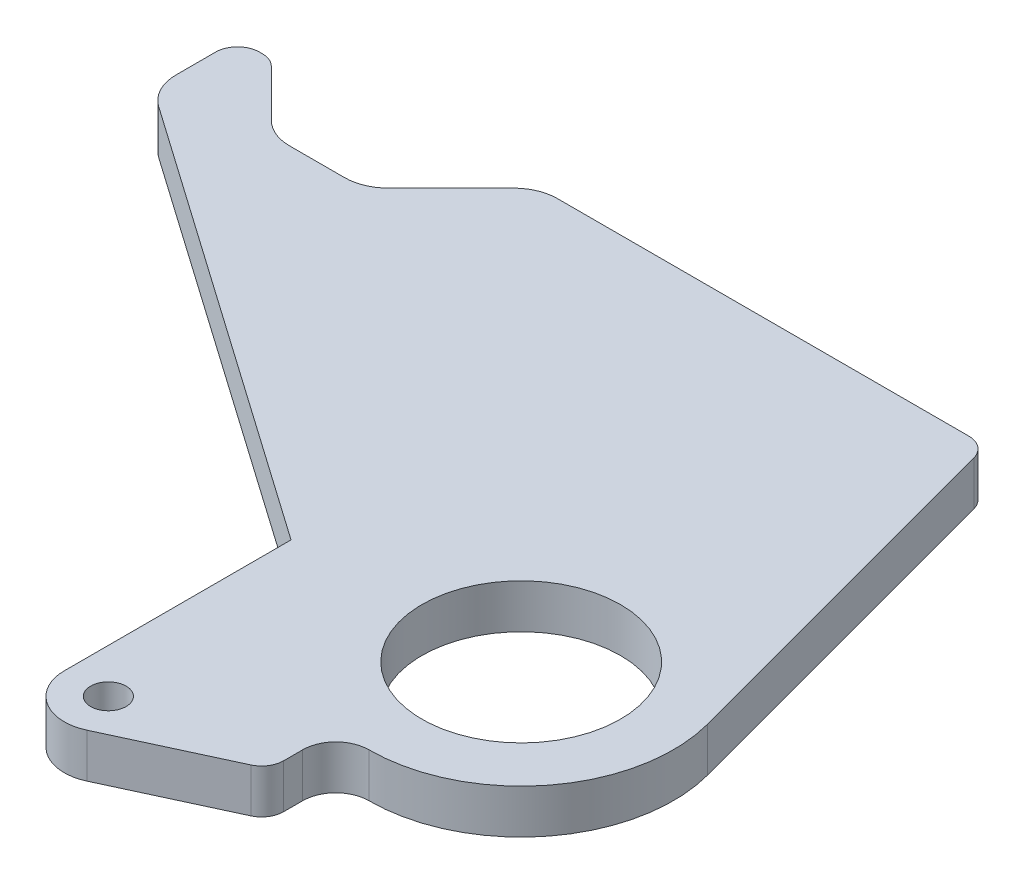
ISO-10303-21;
HEADER;
FILE_DESCRIPTION(('STEP AP214'),'2;1');
FILE_NAME('part.step','',(''),(''),'','','');
FILE_SCHEMA(('AUTOMOTIVE_DESIGN { 1 0 10303 214 1 1 1 1 }'));
ENDSEC;
DATA;
#1=APPLICATION_CONTEXT('core data for automotive mechanical design processes');
#2=APPLICATION_PROTOCOL_DEFINITION('international standard','automotive_design',2000,#1);
#3=PRODUCT_CONTEXT('',#1,'mechanical');
#4=PRODUCT('Part','Part','',(#3));
#5=PRODUCT_RELATED_PRODUCT_CATEGORY('part','',(#4));
#6=PRODUCT_DEFINITION_FORMATION('','',#4);
#7=PRODUCT_DEFINITION_CONTEXT('part definition',#1,'design');
#8=PRODUCT_DEFINITION('design','',#6,#7);
#9=PRODUCT_DEFINITION_SHAPE('','',#8);
#10=(LENGTH_UNIT() NAMED_UNIT(*) SI_UNIT(.MILLI.,.METRE.));
#11=(NAMED_UNIT(*) PLANE_ANGLE_UNIT() SI_UNIT($,.RADIAN.));
#12=(NAMED_UNIT(*) SI_UNIT($,.STERADIAN.) SOLID_ANGLE_UNIT());
#13=UNCERTAINTY_MEASURE_WITH_UNIT(LENGTH_MEASURE(1.E-05),#10,'distance_accuracy_value','');
#14=(GEOMETRIC_REPRESENTATION_CONTEXT(3) GLOBAL_UNCERTAINTY_ASSIGNED_CONTEXT((#13)) GLOBAL_UNIT_ASSIGNED_CONTEXT((#10,
#11,#12)) REPRESENTATION_CONTEXT('',''));
#15=CARTESIAN_POINT('',(0.,0.,0.));
#16=DIRECTION('',(0.,0.,1.));
#17=DIRECTION('',(1.,0.,0.));
#18=AXIS2_PLACEMENT_3D('',#15,#16,#17);
#19=CARTESIAN_POINT('',(4.08001470209327,-6.35,-57.149999999995));
#20=DIRECTION('',(0.,1.,0.));
#21=DIRECTION('',(0.,0.,1.));
#22=AXIS2_PLACEMENT_3D('',#19,#20,#21);
#23=CYLINDRICAL_SURFACE('',#22,3.17500000000001);
#24=CARTESIAN_POINT('',(4.08001470209327,0.,-57.149999999995));
#25=DIRECTION('',(0.,1.,0.));
#26=DIRECTION('',(0.,0.,1.));
#27=AXIS2_PLACEMENT_3D('',#24,#25,#26);
#28=CIRCLE('',#27,3.17500000000001);
#29=CARTESIAN_POINT('',(7.14682920056105,0.,-57.9717504681956));
#30=VERTEX_POINT('',#29);
#31=CARTESIAN_POINT('',(4.08001470209327,0.,-60.324999999995));
#32=VERTEX_POINT('',#31);
#33=EDGE_CURVE('E232',#30,#32,#28,.T.);
#34=ORIENTED_EDGE('',*,*,#33,.F.);
#35=DIRECTION('',(0.,1.,0.));
#36=VECTOR('',#35,1.);
#37=CARTESIAN_POINT('',(7.14682920056105,-6.35,-57.9717504681956));
#38=LINE('',#37,#36);
#39=CARTESIAN_POINT('',(7.14682920056105,-6.35,-57.9717504681956));
#40=VERTEX_POINT('',#39);
#41=EDGE_CURVE('E11',#40,#30,#38,.T.);
#42=ORIENTED_EDGE('',*,*,#41,.F.);
#43=CARTESIAN_POINT('',(4.08001470209327,-6.35,-57.149999999995));
#44=DIRECTION('',(0.,1.,0.));
#45=DIRECTION('',(0.,0.,1.));
#46=AXIS2_PLACEMENT_3D('',#43,#44,#45);
#47=CIRCLE('',#46,3.17500000000001);
#48=CARTESIAN_POINT('',(4.08001470209327,-6.35,-60.324999999995));
#49=VERTEX_POINT('',#48);
#50=EDGE_CURVE('E317',#40,#49,#47,.T.);
#51=ORIENTED_EDGE('',*,*,#50,.T.);
#52=DIRECTION('',(0.,1.,0.));
#53=VECTOR('',#52,1.);
#54=CARTESIAN_POINT('',(4.08001470209327,-6.35,-60.324999999995));
#55=LINE('',#54,#53);
#56=EDGE_CURVE('E48',#49,#32,#55,.T.);
#57=ORIENTED_EDGE('',*,*,#56,.T.);
#58=EDGE_LOOP('',(#34,#42,#51,#57));
#59=FACE_BOUND('',#58,.T.);
#60=ADVANCED_FACE('F45',(#59),#23,.T.);
#61=CARTESIAN_POINT('',(21.1610200394277,-6.35,-5.67007823058398));
#62=DIRECTION('',(0.965925826289062,0.,-0.258819045102544));
#63=DIRECTION('',(-0.258819045102544,0.,-0.965925826289062));
#64=AXIS2_PLACEMENT_3D('',#61,#62,#63);
#65=PLANE('',#64);
#66=DIRECTION('',(-0.258819045102544,0.,-0.965925826289062));
#67=VECTOR('',#66,1.);
#68=CARTESIAN_POINT('',(21.1610200394277,0.,-5.67007823058398));
#69=LINE('',#68,#67);
#70=CARTESIAN_POINT('',(21.1610200394277,0.,-5.67007823058398));
#71=VERTEX_POINT('',#70);
#72=EDGE_CURVE('E314',#71,#30,#69,.T.);
#73=ORIENTED_EDGE('',*,*,#72,.F.);
#74=DIRECTION('',(0.,1.,0.));
#75=VECTOR('',#74,1.);
#76=CARTESIAN_POINT('',(21.1610200394277,-6.35,-5.67007823058398));
#77=LINE('',#76,#75);
#78=CARTESIAN_POINT('',(21.1610200394277,-6.35,-5.67007823058398));
#79=VERTEX_POINT('',#78);
#80=EDGE_CURVE('E55',#79,#71,#77,.T.);
#81=ORIENTED_EDGE('',*,*,#80,.F.);
#82=DIRECTION('',(-0.258819045102544,0.,-0.965925826289062));
#83=VECTOR('',#82,1.);
#84=CARTESIAN_POINT('',(21.1610200394277,-6.35,-5.67007823058398));
#85=LINE('',#84,#83);
#86=EDGE_CURVE('E218',#79,#40,#85,.T.);
#87=ORIENTED_EDGE('',*,*,#86,.T.);
#88=ORIENTED_EDGE('',*,*,#41,.T.);
#89=EDGE_LOOP('',(#73,#81,#87,#88));
#90=FACE_BOUND('',#89,.T.);
#91=ADVANCED_FACE('F377',(#90),#65,.T.);
#92=CARTESIAN_POINT('',(0.,-6.35,0.));
#93=DIRECTION('',(0.,1.,0.));
#94=DIRECTION('',(0.,0.,1.));
#95=AXIS2_PLACEMENT_3D('',#92,#93,#94);
#96=CYLINDRICAL_SURFACE('',#95,21.9075);
#97=CARTESIAN_POINT('',(0.,0.,0.));
#98=DIRECTION('',(0.,1.,0.));
#99=DIRECTION('',(0.,0.,1.));
#100=AXIS2_PLACEMENT_3D('',#97,#98,#99);
#101=CIRCLE('',#100,21.9075);
#102=CARTESIAN_POINT('',(0.,0.,21.9075));
#103=VERTEX_POINT('',#102);
#104=EDGE_CURVE('E204',#103,#71,#101,.T.);
#105=ORIENTED_EDGE('',*,*,#104,.F.);
#106=DIRECTION('',(0.,1.,0.));
#107=VECTOR('',#106,1.);
#108=CARTESIAN_POINT('',(0.,-6.35,21.9075));
#109=LINE('',#108,#107);
#110=CARTESIAN_POINT('',(0.,-6.35,21.9075));
#111=VERTEX_POINT('',#110);
#112=EDGE_CURVE('E199',#111,#103,#109,.T.);
#113=ORIENTED_EDGE('',*,*,#112,.F.);
#114=CARTESIAN_POINT('',(0.,-6.35,0.));
#115=DIRECTION('',(0.,1.,0.));
#116=DIRECTION('',(0.,0.,1.));
#117=AXIS2_PLACEMENT_3D('',#114,#115,#116);
#118=CIRCLE('',#117,21.9075);
#119=EDGE_CURVE('E202',#111,#79,#118,.T.);
#120=ORIENTED_EDGE('',*,*,#119,.T.);
#121=ORIENTED_EDGE('',*,*,#80,.T.);
#122=EDGE_LOOP('',(#105,#113,#120,#121));
#123=FACE_BOUND('',#122,.T.);
#124=ADVANCED_FACE('F201',(#123),#96,.T.);
#125=CARTESIAN_POINT('',(0.,-6.35,26.67));
#126=DIRECTION('',(0.,1.,0.));
#127=DIRECTION('',(0.,0.,1.));
#128=AXIS2_PLACEMENT_3D('',#125,#126,#127);
#129=CYLINDRICAL_SURFACE('',#128,4.7625);
#130=CARTESIAN_POINT('',(0.,0.,26.67));
#131=DIRECTION('',(0.,-1.,0.));
#132=DIRECTION('',(0.,0.,-1.));
#133=AXIS2_PLACEMENT_3D('',#130,#131,#132);
#134=CIRCLE('',#133,4.7625);
#135=CARTESIAN_POINT('',(-4.7625,0.,26.67));
#136=VERTEX_POINT('',#135);
#137=EDGE_CURVE('E309',#136,#103,#134,.T.);
#138=ORIENTED_EDGE('',*,*,#137,.F.);
#139=DIRECTION('',(0.,1.,0.));
#140=VECTOR('',#139,1.);
#141=CARTESIAN_POINT('',(-4.7625,-6.35,26.67));
#142=LINE('',#141,#140);
#143=CARTESIAN_POINT('',(-4.7625,-6.35,26.67));
#144=VERTEX_POINT('',#143);
#145=EDGE_CURVE('E210',#144,#136,#142,.T.);
#146=ORIENTED_EDGE('',*,*,#145,.F.);
#147=CARTESIAN_POINT('',(0.,-6.35,26.67));
#148=DIRECTION('',(0.,-1.,0.));
#149=DIRECTION('',(0.,0.,-1.));
#150=AXIS2_PLACEMENT_3D('',#147,#148,#149);
#151=CIRCLE('',#150,4.7625);
#152=EDGE_CURVE('E216',#144,#111,#151,.T.);
#153=ORIENTED_EDGE('',*,*,#152,.T.);
#154=ORIENTED_EDGE('',*,*,#112,.T.);
#155=EDGE_LOOP('',(#138,#146,#153,#154));
#156=FACE_BOUND('',#155,.T.);
#157=ADVANCED_FACE('F221',(#156),#129,.F.);
#158=CARTESIAN_POINT('',(-4.7625,-6.35,29.4032270908236));
#159=DIRECTION('',(1.,0.,0.));
#160=DIRECTION('',(0.,0.,-1.));
#161=AXIS2_PLACEMENT_3D('',#158,#159,#160);
#162=PLANE('',#161);
#163=DIRECTION('',(0.,0.,-1.));
#164=VECTOR('',#163,1.);
#165=CARTESIAN_POINT('',(-4.7625,0.,29.4032270908236));
#166=LINE('',#165,#164);
#167=CARTESIAN_POINT('',(-4.76250000000001,0.,29.4032270908236));
#168=VERTEX_POINT('',#167);
#169=EDGE_CURVE('E305',#168,#136,#166,.T.);
#170=ORIENTED_EDGE('',*,*,#169,.F.);
#171=DIRECTION('',(0.,1.,0.));
#172=VECTOR('',#171,1.);
#173=CARTESIAN_POINT('',(-4.76250000000001,-6.35,29.4032270908236));
#174=LINE('',#173,#172);
#175=CARTESIAN_POINT('',(-4.76250000000001,-6.35,29.4032270908236));
#176=VERTEX_POINT('',#175);
#177=EDGE_CURVE('E323',#176,#168,#174,.T.);
#178=ORIENTED_EDGE('',*,*,#177,.F.);
#179=DIRECTION('',(0.,0.,-1.));
#180=VECTOR('',#179,1.);
#181=CARTESIAN_POINT('',(-4.7625,-6.35,29.4032270908236));
#182=LINE('',#181,#180);
#183=EDGE_CURVE('E223',#176,#144,#182,.T.);
#184=ORIENTED_EDGE('',*,*,#183,.T.);
#185=ORIENTED_EDGE('',*,*,#145,.T.);
#186=EDGE_LOOP('',(#170,#178,#184,#185));
#187=FACE_BOUND('',#186,.T.);
#188=ADVANCED_FACE('F390',(#187),#162,.T.);
#189=CARTESIAN_POINT('',(-7.93750000000001,-6.35,29.4032270908236));
#190=DIRECTION('',(0.,1.,0.));
#191=DIRECTION('',(0.,0.,1.));
#192=AXIS2_PLACEMENT_3D('',#189,#190,#191);
#193=CYLINDRICAL_SURFACE('',#192,3.175);
#194=CARTESIAN_POINT('',(-7.93750000000001,0.,29.4032270908236));
#195=DIRECTION('',(0.,1.,0.));
#196=DIRECTION('',(0.,0.,1.));
#197=AXIS2_PLACEMENT_3D('',#194,#195,#196);
#198=CIRCLE('',#197,3.175);
#199=CARTESIAN_POINT('',(-6.60416199196349,0.,32.2846910861435));
#200=VERTEX_POINT('',#199);
#201=EDGE_CURVE('E301',#200,#168,#198,.T.);
#202=ORIENTED_EDGE('',*,*,#201,.F.);
#203=DIRECTION('',(0.,1.,0.));
#204=VECTOR('',#203,1.);
#205=CARTESIAN_POINT('',(-6.60416199196349,-6.35,32.2846910861435));
#206=LINE('',#205,#204);
#207=CARTESIAN_POINT('',(-6.60416199196349,-6.35,32.2846910861435));
#208=VERTEX_POINT('',#207);
#209=EDGE_CURVE('E326',#208,#200,#206,.T.);
#210=ORIENTED_EDGE('',*,*,#209,.F.);
#211=CARTESIAN_POINT('',(-7.93750000000001,-6.35,29.4032270908236));
#212=DIRECTION('',(0.,1.,0.));
#213=DIRECTION('',(0.,0.,1.));
#214=AXIS2_PLACEMENT_3D('',#211,#212,#213);
#215=CIRCLE('',#214,3.175);
#216=EDGE_CURVE('E226',#208,#176,#215,.T.);
#217=ORIENTED_EDGE('',*,*,#216,.T.);
#218=ORIENTED_EDGE('',*,*,#177,.T.);
#219=EDGE_LOOP('',(#202,#210,#217,#218));
#220=FACE_BOUND('',#219,.T.);
#221=ADVANCED_FACE('F393',(#220),#193,.T.);
#222=CARTESIAN_POINT('',(-22.7333239839268,-6.35,39.7481279906449));
#223=DIRECTION('',(0.419948978909141,0.,0.907547715061401));
#224=DIRECTION('',(0.907547715061401,0.,-0.419948978909141));
#225=AXIS2_PLACEMENT_3D('',#222,#223,#224);
#226=PLANE('',#225);
#227=DIRECTION('',(0.907547715061401,0.,-0.419948978909141));
#228=VECTOR('',#227,1.);
#229=CARTESIAN_POINT('',(-22.7333239839268,0.,39.7481279906449));
#230=LINE('',#229,#228);
#231=CARTESIAN_POINT('',(-22.7333239839268,0.,39.7481279906449));
#232=VERTEX_POINT('',#231);
#233=EDGE_CURVE('E297',#232,#200,#230,.T.);
#234=ORIENTED_EDGE('',*,*,#233,.F.);
#235=DIRECTION('',(0.,1.,0.));
#236=VECTOR('',#235,1.);
#237=CARTESIAN_POINT('',(-22.7333239839268,-6.35,39.7481279906449));
#238=LINE('',#237,#236);
#239=CARTESIAN_POINT('',(-22.7333239839268,-6.35,39.7481279906449));
#240=VERTEX_POINT('',#239);
#241=EDGE_CURVE('E329',#240,#232,#238,.T.);
#242=ORIENTED_EDGE('',*,*,#241,.F.);
#243=DIRECTION('',(0.907547715061401,0.,-0.419948978909141));
#244=VECTOR('',#243,1.);
#245=CARTESIAN_POINT('',(-22.7333239839268,-6.35,39.7481279906449));
#246=LINE('',#245,#244);
#247=EDGE_CURVE('E557',#240,#208,#246,.T.);
#248=ORIENTED_EDGE('',*,*,#247,.T.);
#249=ORIENTED_EDGE('',*,*,#209,.T.);
#250=EDGE_LOOP('',(#234,#242,#248,#249));
#251=FACE_BOUND('',#250,.T.);
#252=ADVANCED_FACE('F397',(#251),#226,.T.);
#253=CARTESIAN_POINT('',(-25.3999999999999,-6.35,33.9852000000049));
#254=DIRECTION('',(0.,1.,0.));
#255=DIRECTION('',(0.,0.,1.));
#256=AXIS2_PLACEMENT_3D('',#253,#254,#255);
#257=CYLINDRICAL_SURFACE('',#256,6.35000000000007);
#258=CARTESIAN_POINT('',(-25.3999999999999,0.,33.9852000000049));
#259=DIRECTION('',(0.,1.,0.));
#260=DIRECTION('',(0.,0.,1.));
#261=AXIS2_PLACEMENT_3D('',#258,#259,#260);
#262=CIRCLE('',#261,6.35000000000007);
#263=CARTESIAN_POINT('',(-31.75,0.,33.9852000000049));
#264=VERTEX_POINT('',#263);
#265=EDGE_CURVE('E293',#264,#232,#262,.T.);
#266=ORIENTED_EDGE('',*,*,#265,.F.);
#267=DIRECTION('',(0.,1.,0.));
#268=VECTOR('',#267,1.);
#269=CARTESIAN_POINT('',(-31.75,-6.35,33.9852000000049));
#270=LINE('',#269,#268);
#271=CARTESIAN_POINT('',(-31.75,-6.35,33.9852000000049));
#272=VERTEX_POINT('',#271);
#273=EDGE_CURVE('E332',#272,#264,#270,.T.);
#274=ORIENTED_EDGE('',*,*,#273,.F.);
#275=CARTESIAN_POINT('',(-25.3999999999999,-6.35,33.9852000000049));
#276=DIRECTION('',(0.,1.,0.));
#277=DIRECTION('',(0.,0.,1.));
#278=AXIS2_PLACEMENT_3D('',#275,#276,#277);
#279=CIRCLE('',#278,6.35000000000007);
#280=EDGE_CURVE('E553',#272,#240,#279,.T.);
#281=ORIENTED_EDGE('',*,*,#280,.T.);
#282=ORIENTED_EDGE('',*,*,#241,.T.);
#283=EDGE_LOOP('',(#266,#274,#281,#282));
#284=FACE_BOUND('',#283,.T.);
#285=ADVANCED_FACE('F401',(#284),#257,.T.);
#286=CARTESIAN_POINT('',(-31.75,-6.35,1.35932771536862));
#287=DIRECTION('',(-1.,0.,0.));
#288=DIRECTION('',(0.,0.,1.));
#289=AXIS2_PLACEMENT_3D('',#286,#287,#288);
#290=PLANE('',#289);
#291=DIRECTION('',(0.,0.,1.));
#292=VECTOR('',#291,1.);
#293=CARTESIAN_POINT('',(-31.75,0.,1.35932771536862));
#294=LINE('',#293,#292);
#295=CARTESIAN_POINT('',(-31.75,0.,1.35932771536862));
#296=VERTEX_POINT('',#295);
#297=EDGE_CURVE('E289',#296,#264,#294,.T.);
#298=ORIENTED_EDGE('',*,*,#297,.F.);
#299=DIRECTION('',(0.,1.,0.));
#300=VECTOR('',#299,1.);
#301=CARTESIAN_POINT('',(-31.75,-6.35,1.35932771536862));
#302=LINE('',#301,#300);
#303=CARTESIAN_POINT('',(-31.75,-6.35,1.35932771536862));
#304=VERTEX_POINT('',#303);
#305=EDGE_CURVE('E335',#304,#296,#302,.T.);
#306=ORIENTED_EDGE('',*,*,#305,.F.);
#307=DIRECTION('',(0.,0.,1.));
#308=VECTOR('',#307,1.);
#309=CARTESIAN_POINT('',(-31.75,-6.35,1.35932771536862));
#310=LINE('',#309,#308);
#311=EDGE_CURVE('E549',#304,#272,#310,.T.);
#312=ORIENTED_EDGE('',*,*,#311,.T.);
#313=ORIENTED_EDGE('',*,*,#273,.T.);
#314=EDGE_LOOP('',(#298,#306,#312,#313));
#315=FACE_BOUND('',#314,.T.);
#316=ADVANCED_FACE('F405',(#315),#290,.T.);
#317=CARTESIAN_POINT('',(-95.2409603708292,-6.35,-43.0975213444609));
#318=DIRECTION('',(-0.573576436351054,0.,0.819152044288986));
#319=DIRECTION('',(0.819152044288986,0.,0.573576436351054));
#320=AXIS2_PLACEMENT_3D('',#317,#318,#319);
#321=PLANE('',#320);
#322=DIRECTION('',(0.819152044288986,0.,0.573576436351054));
#323=VECTOR('',#322,1.);
#324=CARTESIAN_POINT('',(-95.2409603708292,0.,-43.0975213444609));
#325=LINE('',#324,#323);
#326=CARTESIAN_POINT('',(-95.2409603708292,0.,-43.0975213444609));
#327=VERTEX_POINT('',#326);
#328=EDGE_CURVE('E285',#327,#296,#325,.T.);
#329=ORIENTED_EDGE('',*,*,#328,.F.);
#330=DIRECTION('',(0.,1.,0.));
#331=VECTOR('',#330,1.);
#332=CARTESIAN_POINT('',(-95.2409603708292,-6.35,-43.0975213444609));
#333=LINE('',#332,#331);
#334=CARTESIAN_POINT('',(-95.2409603708292,-6.35,-43.0975213444609));
#335=VERTEX_POINT('',#334);
#336=EDGE_CURVE('E338',#335,#327,#333,.T.);
#337=ORIENTED_EDGE('',*,*,#336,.F.);
#338=DIRECTION('',(0.819152044288986,0.,0.573576436351054));
#339=VECTOR('',#338,1.);
#340=CARTESIAN_POINT('',(-95.2409603708292,-6.35,-43.0975213444609));
#341=LINE('',#340,#339);
#342=EDGE_CURVE('E545',#335,#304,#341,.T.);
#343=ORIENTED_EDGE('',*,*,#342,.T.);
#344=ORIENTED_EDGE('',*,*,#305,.T.);
#345=EDGE_LOOP('',(#329,#337,#343,#344));
#346=FACE_BOUND('',#345,.T.);
#347=ADVANCED_FACE('F409',(#346),#321,.T.);
#348=CARTESIAN_POINT('',(-91.59875,-6.35,-48.2991368256959));
#349=DIRECTION('',(0.,1.,0.));
#350=DIRECTION('',(0.,0.,1.));
#351=AXIS2_PLACEMENT_3D('',#348,#349,#350);
#352=CYLINDRICAL_SURFACE('',#351,6.34999999999996);
#353=CARTESIAN_POINT('',(-91.59875,0.,-48.2991368256959));
#354=DIRECTION('',(0.,1.,0.));
#355=DIRECTION('',(0.,0.,1.));
#356=AXIS2_PLACEMENT_3D('',#353,#354,#355);
#357=CIRCLE('',#356,6.34999999999996);
#358=CARTESIAN_POINT('',(-97.94875,0.,-48.2991368256959));
#359=VERTEX_POINT('',#358);
#360=EDGE_CURVE('E281',#359,#327,#357,.T.);
#361=ORIENTED_EDGE('',*,*,#360,.F.);
#362=DIRECTION('',(0.,1.,0.));
#363=VECTOR('',#362,1.);
#364=CARTESIAN_POINT('',(-97.94875,-6.35,-48.2991368256959));
#365=LINE('',#364,#363);
#366=CARTESIAN_POINT('',(-97.94875,-6.35,-48.2991368256959));
#367=VERTEX_POINT('',#366);
#368=EDGE_CURVE('E341',#367,#359,#365,.T.);
#369=ORIENTED_EDGE('',*,*,#368,.F.);
#370=CARTESIAN_POINT('',(-91.59875,-6.35,-48.2991368256959));
#371=DIRECTION('',(0.,1.,0.));
#372=DIRECTION('',(0.,0.,1.));
#373=AXIS2_PLACEMENT_3D('',#370,#371,#372);
#374=CIRCLE('',#373,6.34999999999996);
#375=EDGE_CURVE('E541',#367,#335,#374,.T.);
#376=ORIENTED_EDGE('',*,*,#375,.T.);
#377=ORIENTED_EDGE('',*,*,#336,.T.);
#378=EDGE_LOOP('',(#361,#369,#376,#377));
#379=FACE_BOUND('',#378,.T.);
#380=ADVANCED_FACE('F413',(#379),#352,.T.);
#381=CARTESIAN_POINT('',(-97.94875,-6.35,-53.974999999995));
#382=DIRECTION('',(-1.,0.,0.));
#383=DIRECTION('',(0.,0.,1.));
#384=AXIS2_PLACEMENT_3D('',#381,#382,#383);
#385=PLANE('',#384);
#386=DIRECTION('',(0.,0.,1.));
#387=VECTOR('',#386,1.);
#388=CARTESIAN_POINT('',(-97.94875,0.,-53.974999999995));
#389=LINE('',#388,#387);
#390=CARTESIAN_POINT('',(-97.94875,0.,-53.974999999995));
#391=VERTEX_POINT('',#390);
#392=EDGE_CURVE('E277',#391,#359,#389,.T.);
#393=ORIENTED_EDGE('',*,*,#392,.F.);
#394=DIRECTION('',(0.,1.,0.));
#395=VECTOR('',#394,1.);
#396=CARTESIAN_POINT('',(-97.94875,-6.35,-53.974999999995));
#397=LINE('',#396,#395);
#398=CARTESIAN_POINT('',(-97.94875,-6.35,-53.974999999995));
#399=VERTEX_POINT('',#398);
#400=EDGE_CURVE('E344',#399,#391,#397,.T.);
#401=ORIENTED_EDGE('',*,*,#400,.F.);
#402=DIRECTION('',(0.,0.,1.));
#403=VECTOR('',#402,1.);
#404=CARTESIAN_POINT('',(-97.94875,-6.35,-53.974999999995));
#405=LINE('',#404,#403);
#406=EDGE_CURVE('E537',#399,#367,#405,.T.);
#407=ORIENTED_EDGE('',*,*,#406,.T.);
#408=ORIENTED_EDGE('',*,*,#368,.T.);
#409=EDGE_LOOP('',(#393,#401,#407,#408));
#410=FACE_BOUND('',#409,.T.);
#411=ADVANCED_FACE('F417',(#410),#385,.T.);
#412=CARTESIAN_POINT('',(-94.77375,-6.35,-53.974999999995));
#413=DIRECTION('',(0.,1.,0.));
#414=DIRECTION('',(0.,0.,1.));
#415=AXIS2_PLACEMENT_3D('',#412,#413,#414);
#416=CYLINDRICAL_SURFACE('',#415,3.175);
#417=CARTESIAN_POINT('',(-94.77375,0.,-53.974999999995));
#418=DIRECTION('',(0.,1.,0.));
#419=DIRECTION('',(0.,0.,1.));
#420=AXIS2_PLACEMENT_3D('',#417,#418,#419);
#421=CIRCLE('',#420,3.175);
#422=CARTESIAN_POINT('',(-94.77375,0.,-57.149999999995));
#423=VERTEX_POINT('',#422);
#424=EDGE_CURVE('E273',#423,#391,#421,.T.);
#425=ORIENTED_EDGE('',*,*,#424,.F.);
#426=DIRECTION('',(0.,1.,0.));
#427=VECTOR('',#426,1.);
#428=CARTESIAN_POINT('',(-94.77375,-6.35,-57.149999999995));
#429=LINE('',#428,#427);
#430=CARTESIAN_POINT('',(-94.77375,-6.35,-57.149999999995));
#431=VERTEX_POINT('',#430);
#432=EDGE_CURVE('E347',#431,#423,#429,.T.);
#433=ORIENTED_EDGE('',*,*,#432,.F.);
#434=CARTESIAN_POINT('',(-94.77375,-6.35,-53.974999999995));
#435=DIRECTION('',(0.,1.,0.));
#436=DIRECTION('',(0.,0.,1.));
#437=AXIS2_PLACEMENT_3D('',#434,#435,#436);
#438=CIRCLE('',#437,3.175);
#439=EDGE_CURVE('E533',#431,#399,#438,.T.);
#440=ORIENTED_EDGE('',*,*,#439,.T.);
#441=ORIENTED_EDGE('',*,*,#400,.T.);
#442=EDGE_LOOP('',(#425,#433,#440,#441));
#443=FACE_BOUND('',#442,.T.);
#444=ADVANCED_FACE('F421',(#443),#416,.T.);
#445=CARTESIAN_POINT('',(-94.4095183632075,-6.35,-57.149999999995));
#446=DIRECTION('',(0.,0.,-1.));
#447=DIRECTION('',(-1.,0.,0.));
#448=AXIS2_PLACEMENT_3D('',#445,#446,#447);
#449=PLANE('',#448);
#450=DIRECTION('',(-1.,0.,0.));
#451=VECTOR('',#450,1.);
#452=CARTESIAN_POINT('',(-94.4095183632075,0.,-57.149999999995));
#453=LINE('',#452,#451);
#454=CARTESIAN_POINT('',(-94.4095183632075,0.,-57.149999999995));
#455=VERTEX_POINT('',#454);
#456=EDGE_CURVE('E269',#455,#423,#453,.T.);
#457=ORIENTED_EDGE('',*,*,#456,.F.);
#458=DIRECTION('',(0.,1.,0.));
#459=VECTOR('',#458,1.);
#460=CARTESIAN_POINT('',(-94.4095183632075,-6.35,-57.149999999995));
#461=LINE('',#460,#459);
#462=CARTESIAN_POINT('',(-94.4095183632075,-6.35,-57.149999999995));
#463=VERTEX_POINT('',#462);
#464=EDGE_CURVE('E350',#463,#455,#461,.T.);
#465=ORIENTED_EDGE('',*,*,#464,.F.);
#466=DIRECTION('',(-1.,0.,0.));
#467=VECTOR('',#466,1.);
#468=CARTESIAN_POINT('',(-94.4095183632075,-6.35,-57.149999999995));
#469=LINE('',#468,#467);
#470=EDGE_CURVE('E529',#463,#431,#469,.T.);
#471=ORIENTED_EDGE('',*,*,#470,.T.);
#472=ORIENTED_EDGE('',*,*,#432,.T.);
#473=EDGE_LOOP('',(#457,#465,#471,#472));
#474=FACE_BOUND('',#473,.T.);
#475=ADVANCED_FACE('F425',(#474),#449,.T.);
#476=CARTESIAN_POINT('',(-94.4095183632075,-6.35,-53.974999999995));
#477=DIRECTION('',(0.,1.,0.));
#478=DIRECTION('',(0.,0.,1.));
#479=AXIS2_PLACEMENT_3D('',#476,#477,#478);
#480=CYLINDRICAL_SURFACE('',#479,3.175);
#481=CARTESIAN_POINT('',(-94.4095183632075,0.,-53.974999999995));
#482=DIRECTION('',(0.,1.,0.));
#483=DIRECTION('',(0.,0.,1.));
#484=AXIS2_PLACEMENT_3D('',#481,#482,#483);
#485=CIRCLE('',#484,3.175);
#486=CARTESIAN_POINT('',(-92.1644543329402,0.,-56.2200640302623));
#487=VERTEX_POINT('',#486);
#488=EDGE_CURVE('E265',#487,#455,#485,.T.);
#489=ORIENTED_EDGE('',*,*,#488,.F.);
#490=DIRECTION('',(0.,1.,0.));
#491=VECTOR('',#490,1.);
#492=CARTESIAN_POINT('',(-92.1644543329402,-6.35,-56.2200640302623));
#493=LINE('',#492,#491);
#494=CARTESIAN_POINT('',(-92.1644543329402,-6.35,-56.2200640302623));
#495=VERTEX_POINT('',#494);
#496=EDGE_CURVE('E353',#495,#487,#493,.T.);
#497=ORIENTED_EDGE('',*,*,#496,.F.);
#498=CARTESIAN_POINT('',(-94.4095183632075,-6.35,-53.974999999995));
#499=DIRECTION('',(0.,1.,0.));
#500=DIRECTION('',(0.,0.,1.));
#501=AXIS2_PLACEMENT_3D('',#498,#499,#500);
#502=CIRCLE('',#501,3.175);
#503=EDGE_CURVE('E525',#495,#463,#502,.T.);
#504=ORIENTED_EDGE('',*,*,#503,.T.);
#505=ORIENTED_EDGE('',*,*,#464,.T.);
#506=EDGE_LOOP('',(#489,#497,#504,#505));
#507=FACE_BOUND('',#506,.T.);
#508=ADVANCED_FACE('F429',(#507),#480,.T.);
#509=CARTESIAN_POINT('',(-85.4292622421383,-6.35,-49.4848719394604));
#510=DIRECTION('',(0.707106781186545,0.,-0.70710678118655));
#511=DIRECTION('',(-0.70710678118655,0.,-0.707106781186545));
#512=AXIS2_PLACEMENT_3D('',#509,#510,#511);
#513=PLANE('',#512);
#514=DIRECTION('',(-0.707106781186551,0.,-0.707106781186545));
#515=VECTOR('',#514,1.);
#516=CARTESIAN_POINT('',(-85.4292622421383,0.,-49.4848719394604));
#517=LINE('',#516,#515);
#518=CARTESIAN_POINT('',(-85.4292622421383,0.,-49.4848719394604));
#519=VERTEX_POINT('',#518);
#520=EDGE_CURVE('E261',#519,#487,#517,.T.);
#521=ORIENTED_EDGE('',*,*,#520,.F.);
#522=DIRECTION('',(0.,1.,0.));
#523=VECTOR('',#522,1.);
#524=CARTESIAN_POINT('',(-85.4292622421383,-6.35,-49.4848719394604));
#525=LINE('',#524,#523);
#526=CARTESIAN_POINT('',(-85.4292622421383,-6.35,-49.4848719394604));
#527=VERTEX_POINT('',#526);
#528=EDGE_CURVE('E356',#527,#519,#525,.T.);
#529=ORIENTED_EDGE('',*,*,#528,.F.);
#530=DIRECTION('',(-0.707106781186551,0.,-0.707106781186545));
#531=VECTOR('',#530,1.);
#532=CARTESIAN_POINT('',(-85.4292622421383,-6.35,-49.4848719394604));
#533=LINE('',#532,#531);
#534=EDGE_CURVE('E521',#527,#495,#533,.T.);
#535=ORIENTED_EDGE('',*,*,#534,.T.);
#536=ORIENTED_EDGE('',*,*,#496,.T.);
#537=EDGE_LOOP('',(#521,#529,#535,#536));
#538=FACE_BOUND('',#537,.T.);
#539=ADVANCED_FACE('F433',(#538),#513,.T.);
#540=CARTESIAN_POINT('',(-80.9391341816037,-6.35,-53.974999999995));
#541=DIRECTION('',(0.,1.,0.));
#542=DIRECTION('',(0.,0.,1.));
#543=AXIS2_PLACEMENT_3D('',#540,#541,#542);
#544=CYLINDRICAL_SURFACE('',#543,6.34999999999999);
#545=CARTESIAN_POINT('',(-80.9391341816037,0.,-53.974999999995));
#546=DIRECTION('',(0.,-1.,0.));
#547=DIRECTION('',(0.,0.,-1.));
#548=AXIS2_PLACEMENT_3D('',#545,#546,#547);
#549=CIRCLE('',#548,6.34999999999999);
#550=CARTESIAN_POINT('',(-80.9391341816037,0.,-47.624999999995));
#551=VERTEX_POINT('',#550);
#552=EDGE_CURVE('E257',#551,#519,#549,.T.);
#553=ORIENTED_EDGE('',*,*,#552,.F.);
#554=DIRECTION('',(0.,1.,0.));
#555=VECTOR('',#554,1.);
#556=CARTESIAN_POINT('',(-80.9391341816037,-6.35,-47.624999999995));
#557=LINE('',#556,#555);
#558=CARTESIAN_POINT('',(-80.9391341816037,-6.35,-47.624999999995));
#559=VERTEX_POINT('',#558);
#560=EDGE_CURVE('E359',#559,#551,#557,.T.);
#561=ORIENTED_EDGE('',*,*,#560,.F.);
#562=CARTESIAN_POINT('',(-80.9391341816037,-6.35,-53.974999999995));
#563=DIRECTION('',(0.,-1.,0.));
#564=DIRECTION('',(0.,0.,-1.));
#565=AXIS2_PLACEMENT_3D('',#562,#563,#564);
#566=CIRCLE('',#565,6.34999999999999);
#567=EDGE_CURVE('E517',#559,#527,#566,.T.);
#568=ORIENTED_EDGE('',*,*,#567,.T.);
#569=ORIENTED_EDGE('',*,*,#528,.T.);
#570=EDGE_LOOP('',(#553,#561,#568,#569));
#571=FACE_BOUND('',#570,.T.);
#572=ADVANCED_FACE('F437',(#571),#544,.F.);
#573=CARTESIAN_POINT('',(-73.0483658183963,-6.35,-47.624999999995));
#574=DIRECTION('',(0.,0.,-1.));
#575=DIRECTION('',(-1.,0.,0.));
#576=AXIS2_PLACEMENT_3D('',#573,#574,#575);
#577=PLANE('',#576);
#578=DIRECTION('',(-1.,0.,0.));
#579=VECTOR('',#578,1.);
#580=CARTESIAN_POINT('',(-73.0483658183963,0.,-47.624999999995));
#581=LINE('',#580,#579);
#582=CARTESIAN_POINT('',(-73.0483658183963,0.,-47.624999999995));
#583=VERTEX_POINT('',#582);
#584=EDGE_CURVE('E253',#583,#551,#581,.T.);
#585=ORIENTED_EDGE('',*,*,#584,.F.);
#586=DIRECTION('',(0.,1.,0.));
#587=VECTOR('',#586,1.);
#588=CARTESIAN_POINT('',(-73.0483658183963,-6.35,-47.624999999995));
#589=LINE('',#588,#587);
#590=CARTESIAN_POINT('',(-73.0483658183963,-6.35,-47.624999999995));
#591=VERTEX_POINT('',#590);
#592=EDGE_CURVE('E362',#591,#583,#589,.T.);
#593=ORIENTED_EDGE('',*,*,#592,.F.);
#594=DIRECTION('',(-1.,0.,0.));
#595=VECTOR('',#594,1.);
#596=CARTESIAN_POINT('',(-73.0483658183963,-6.35,-47.624999999995));
#597=LINE('',#596,#595);
#598=EDGE_CURVE('E513',#591,#559,#597,.T.);
#599=ORIENTED_EDGE('',*,*,#598,.T.);
#600=ORIENTED_EDGE('',*,*,#560,.T.);
#601=EDGE_LOOP('',(#585,#593,#599,#600));
#602=FACE_BOUND('',#601,.T.);
#603=ADVANCED_FACE('F441',(#602),#577,.T.);
#604=CARTESIAN_POINT('',(-73.0483658183963,-6.35,-53.974999999995));
#605=DIRECTION('',(0.,1.,0.));
#606=DIRECTION('',(0.,0.,1.));
#607=AXIS2_PLACEMENT_3D('',#604,#605,#606);
#608=CYLINDRICAL_SURFACE('',#607,6.34999999999999);
#609=CARTESIAN_POINT('',(-73.0483658183963,0.,-53.974999999995));
#610=DIRECTION('',(0.,-1.,0.));
#611=DIRECTION('',(0.,0.,-1.));
#612=AXIS2_PLACEMENT_3D('',#609,#610,#611);
#613=CIRCLE('',#612,6.34999999999999);
#614=CARTESIAN_POINT('',(-68.5582377578617,0.,-49.4848719394604));
#615=VERTEX_POINT('',#614);
#616=EDGE_CURVE('E249',#615,#583,#613,.T.);
#617=ORIENTED_EDGE('',*,*,#616,.F.);
#618=DIRECTION('',(0.,1.,0.));
#619=VECTOR('',#618,1.);
#620=CARTESIAN_POINT('',(-68.5582377578617,-6.35,-49.4848719394604));
#621=LINE('',#620,#619);
#622=CARTESIAN_POINT('',(-68.5582377578617,-6.35,-49.4848719394604));
#623=VERTEX_POINT('',#622);
#624=EDGE_CURVE('E365',#623,#615,#621,.T.);
#625=ORIENTED_EDGE('',*,*,#624,.F.);
#626=CARTESIAN_POINT('',(-73.0483658183963,-6.35,-53.974999999995));
#627=DIRECTION('',(0.,-1.,0.));
#628=DIRECTION('',(0.,0.,-1.));
#629=AXIS2_PLACEMENT_3D('',#626,#627,#628);
#630=CIRCLE('',#629,6.34999999999999);
#631=EDGE_CURVE('E509',#623,#591,#630,.T.);
#632=ORIENTED_EDGE('',*,*,#631,.T.);
#633=ORIENTED_EDGE('',*,*,#592,.T.);
#634=EDGE_LOOP('',(#617,#625,#632,#633));
#635=FACE_BOUND('',#634,.T.);
#636=ADVANCED_FACE('F445',(#635),#608,.F.);
#637=CARTESIAN_POINT('',(-59.5779816367924,-6.35,-58.4651280605296));
#638=DIRECTION('',(-0.707106781186542,0.,-0.707106781186553));
#639=DIRECTION('',(-0.707106781186553,0.,0.707106781186542));
#640=AXIS2_PLACEMENT_3D('',#637,#638,#639);
#641=PLANE('',#640);
#642=DIRECTION('',(-0.707106781186553,0.,0.707106781186542));
#643=VECTOR('',#642,1.);
#644=CARTESIAN_POINT('',(-59.5779816367924,0.,-58.4651280605296));
#645=LINE('',#644,#643);
#646=CARTESIAN_POINT('',(-59.5779816367924,0.,-58.4651280605296));
#647=VERTEX_POINT('',#646);
#648=EDGE_CURVE('E245',#647,#615,#645,.T.);
#649=ORIENTED_EDGE('',*,*,#648,.F.);
#650=DIRECTION('',(0.,1.,0.));
#651=VECTOR('',#650,1.);
#652=CARTESIAN_POINT('',(-59.5779816367924,-6.35,-58.4651280605296));
#653=LINE('',#652,#651);
#654=CARTESIAN_POINT('',(-59.5779816367924,-6.35,-58.4651280605296));
#655=VERTEX_POINT('',#654);
#656=EDGE_CURVE('E368',#655,#647,#653,.T.);
#657=ORIENTED_EDGE('',*,*,#656,.F.);
#658=DIRECTION('',(-0.707106781186553,0.,0.707106781186542));
#659=VECTOR('',#658,1.);
#660=CARTESIAN_POINT('',(-59.5779816367924,-6.35,-58.4651280605296));
#661=LINE('',#660,#659);
#662=EDGE_CURVE('E505',#655,#623,#661,.T.);
#663=ORIENTED_EDGE('',*,*,#662,.T.);
#664=ORIENTED_EDGE('',*,*,#624,.T.);
#665=EDGE_LOOP('',(#649,#657,#663,#664));
#666=FACE_BOUND('',#665,.T.);
#667=ADVANCED_FACE('F449',(#666),#641,.T.);
#668=CARTESIAN_POINT('',(-55.0878535762579,-6.35,-53.974999999995));
#669=DIRECTION('',(0.,1.,0.));
#670=DIRECTION('',(0.,0.,1.));
#671=AXIS2_PLACEMENT_3D('',#668,#669,#670);
#672=CYLINDRICAL_SURFACE('',#671,6.34999999999997);
#673=CARTESIAN_POINT('',(-55.0878535762579,0.,-53.974999999995));
#674=DIRECTION('',(0.,1.,0.));
#675=DIRECTION('',(0.,0.,1.));
#676=AXIS2_PLACEMENT_3D('',#673,#674,#675);
#677=CIRCLE('',#676,6.34999999999997);
#678=CARTESIAN_POINT('',(-55.0878535762579,0.,-60.324999999995));
#679=VERTEX_POINT('',#678);
#680=EDGE_CURVE('E241',#679,#647,#677,.T.);
#681=ORIENTED_EDGE('',*,*,#680,.F.);
#682=DIRECTION('',(0.,1.,0.));
#683=VECTOR('',#682,1.);
#684=CARTESIAN_POINT('',(-55.0878535762579,-6.35,-60.324999999995));
#685=LINE('',#684,#683);
#686=CARTESIAN_POINT('',(-55.0878535762579,-6.35,-60.324999999995));
#687=VERTEX_POINT('',#686);
#688=EDGE_CURVE('E370',#687,#679,#685,.T.);
#689=ORIENTED_EDGE('',*,*,#688,.F.);
#690=CARTESIAN_POINT('',(-55.0878535762579,-6.35,-53.974999999995));
#691=DIRECTION('',(0.,1.,0.));
#692=DIRECTION('',(0.,0.,1.));
#693=AXIS2_PLACEMENT_3D('',#690,#691,#692);
#694=CIRCLE('',#693,6.34999999999997);
#695=EDGE_CURVE('E501',#687,#655,#694,.T.);
#696=ORIENTED_EDGE('',*,*,#695,.T.);
#697=ORIENTED_EDGE('',*,*,#656,.T.);
#698=EDGE_LOOP('',(#681,#689,#696,#697));
#699=FACE_BOUND('',#698,.T.);
#700=ADVANCED_FACE('F453',(#699),#672,.T.);
#701=CARTESIAN_POINT('',(4.08001470209327,-6.35,-60.324999999995));
#702=DIRECTION('',(0.,0.,-1.));
#703=DIRECTION('',(-1.,0.,0.));
#704=AXIS2_PLACEMENT_3D('',#701,#702,#703);
#705=PLANE('',#704);
#706=DIRECTION('',(-1.,0.,0.));
#707=VECTOR('',#706,1.);
#708=CARTESIAN_POINT('',(4.08001470209327,0.,-60.324999999995));
#709=LINE('',#708,#707);
#710=EDGE_CURVE('E236',#32,#679,#709,.T.);
#711=ORIENTED_EDGE('',*,*,#710,.F.);
#712=ORIENTED_EDGE('',*,*,#56,.F.);
#713=DIRECTION('',(-1.,0.,0.));
#714=VECTOR('',#713,1.);
#715=CARTESIAN_POINT('',(4.08001470209327,-6.35,-60.324999999995));
#716=LINE('',#715,#714);
#717=EDGE_CURVE('E498',#49,#687,#716,.T.);
#718=ORIENTED_EDGE('',*,*,#717,.T.);
#719=ORIENTED_EDGE('',*,*,#688,.T.);
#720=EDGE_LOOP('',(#711,#712,#718,#719));
#721=FACE_BOUND('',#720,.T.);
#722=ADVANCED_FACE('F374',(#721),#705,.T.);
#723=CARTESIAN_POINT('',(4.08001470209327,-6.35,-57.149999999995));
#724=DIRECTION('',(0.,1.,0.));
#725=DIRECTION('',(0.,0.,1.));
#726=AXIS2_PLACEMENT_3D('',#723,#724,#725);
#727=PLANE('',#726);
#728=CARTESIAN_POINT('',(0.,-6.35,0.));
#729=DIRECTION('',(0.,1.,0.));
#730=DIRECTION('',(0.,0.,-1.));
#731=AXIS2_PLACEMENT_3D('',#728,#729,#730);
#732=CIRCLE('',#731,14.2875);
#733=CARTESIAN_POINT('',(0.,-6.35,-14.2875));
#734=VERTEX_POINT('',#733);
#735=EDGE_CURVE('E480',#734,#734,#732,.T.);
#736=ORIENTED_EDGE('',*,*,#735,.T.);
#737=EDGE_LOOP('',(#736));
#738=FACE_BOUND('',#737,.T.);
#739=CARTESIAN_POINT('',(-25.3999999999999,-6.35,33.9852000000049));
#740=DIRECTION('',(0.,1.,0.));
#741=DIRECTION('',(0.,0.,-1.));
#742=AXIS2_PLACEMENT_3D('',#739,#740,#741);
#743=CIRCLE('',#742,2.55270000000141);
#744=CARTESIAN_POINT('',(-25.3999999999999,-6.35,31.4325000000035));
#745=VERTEX_POINT('',#744);
#746=EDGE_CURVE('E237',#745,#745,#743,.T.);
#747=ORIENTED_EDGE('',*,*,#746,.T.);
#748=EDGE_LOOP('',(#747));
#749=FACE_BOUND('',#748,.T.);
#750=ORIENTED_EDGE('',*,*,#50,.F.);
#751=ORIENTED_EDGE('',*,*,#86,.F.);
#752=ORIENTED_EDGE('',*,*,#119,.F.);
#753=ORIENTED_EDGE('',*,*,#152,.F.);
#754=ORIENTED_EDGE('',*,*,#183,.F.);
#755=ORIENTED_EDGE('',*,*,#216,.F.);
#756=ORIENTED_EDGE('',*,*,#247,.F.);
#757=ORIENTED_EDGE('',*,*,#280,.F.);
#758=ORIENTED_EDGE('',*,*,#311,.F.);
#759=ORIENTED_EDGE('',*,*,#342,.F.);
#760=ORIENTED_EDGE('',*,*,#375,.F.);
#761=ORIENTED_EDGE('',*,*,#406,.F.);
#762=ORIENTED_EDGE('',*,*,#439,.F.);
#763=ORIENTED_EDGE('',*,*,#470,.F.);
#764=ORIENTED_EDGE('',*,*,#503,.F.);
#765=ORIENTED_EDGE('',*,*,#534,.F.);
#766=ORIENTED_EDGE('',*,*,#567,.F.);
#767=ORIENTED_EDGE('',*,*,#598,.F.);
#768=ORIENTED_EDGE('',*,*,#631,.F.);
#769=ORIENTED_EDGE('',*,*,#662,.F.);
#770=ORIENTED_EDGE('',*,*,#695,.F.);
#771=ORIENTED_EDGE('',*,*,#717,.F.);
#772=EDGE_LOOP('',(#750,#751,#752,#753,#754,#755,#756,#757,#758,#759,#760,#761,#762,#763,#764,
#765,#766,#767,#768,#769,#770,#771));
#773=FACE_BOUND('',#772,.T.);
#774=ADVANCED_FACE('F214',(#738,#749,#773),#727,.F.);
#775=CARTESIAN_POINT('',(4.08001470209327,0.,-57.149999999995));
#776=DIRECTION('',(0.,1.,0.));
#777=DIRECTION('',(0.,0.,1.));
#778=AXIS2_PLACEMENT_3D('',#775,#776,#777);
#779=PLANE('',#778);
#780=CARTESIAN_POINT('',(0.,0.,0.));
#781=DIRECTION('',(0.,1.,0.));
#782=DIRECTION('',(0.,0.,-1.));
#783=AXIS2_PLACEMENT_3D('',#780,#781,#782);
#784=CIRCLE('',#783,14.2875);
#785=CARTESIAN_POINT('',(0.,0.,-14.2875));
#786=VERTEX_POINT('',#785);
#787=EDGE_CURVE('E483',#786,#786,#784,.T.);
#788=ORIENTED_EDGE('',*,*,#787,.F.);
#789=EDGE_LOOP('',(#788));
#790=FACE_BOUND('',#789,.T.);
#791=CARTESIAN_POINT('',(-25.3999999999999,0.,33.9852000000049));
#792=DIRECTION('',(0.,1.,0.));
#793=DIRECTION('',(0.,0.,-1.));
#794=AXIS2_PLACEMENT_3D('',#791,#792,#793);
#795=CIRCLE('',#794,2.55270000000141);
#796=CARTESIAN_POINT('',(-25.3999999999999,0.,31.4325000000035));
#797=VERTEX_POINT('',#796);
#798=EDGE_CURVE('E487',#797,#797,#795,.T.);
#799=ORIENTED_EDGE('',*,*,#798,.F.);
#800=EDGE_LOOP('',(#799));
#801=FACE_BOUND('',#800,.T.);
#802=ORIENTED_EDGE('',*,*,#33,.T.);
#803=ORIENTED_EDGE('',*,*,#710,.T.);
#804=ORIENTED_EDGE('',*,*,#680,.T.);
#805=ORIENTED_EDGE('',*,*,#648,.T.);
#806=ORIENTED_EDGE('',*,*,#616,.T.);
#807=ORIENTED_EDGE('',*,*,#584,.T.);
#808=ORIENTED_EDGE('',*,*,#552,.T.);
#809=ORIENTED_EDGE('',*,*,#520,.T.);
#810=ORIENTED_EDGE('',*,*,#488,.T.);
#811=ORIENTED_EDGE('',*,*,#456,.T.);
#812=ORIENTED_EDGE('',*,*,#424,.T.);
#813=ORIENTED_EDGE('',*,*,#392,.T.);
#814=ORIENTED_EDGE('',*,*,#360,.T.);
#815=ORIENTED_EDGE('',*,*,#328,.T.);
#816=ORIENTED_EDGE('',*,*,#297,.T.);
#817=ORIENTED_EDGE('',*,*,#265,.T.);
#818=ORIENTED_EDGE('',*,*,#233,.T.);
#819=ORIENTED_EDGE('',*,*,#201,.T.);
#820=ORIENTED_EDGE('',*,*,#169,.T.);
#821=ORIENTED_EDGE('',*,*,#137,.T.);
#822=ORIENTED_EDGE('',*,*,#104,.T.);
#823=ORIENTED_EDGE('',*,*,#72,.T.);
#824=EDGE_LOOP('',(#802,#803,#804,#805,#806,#807,#808,#809,#810,#811,#812,#813,#814,#815,#816,
#817,#818,#819,#820,#821,#822,#823));
#825=FACE_BOUND('',#824,.T.);
#826=ADVANCED_FACE('F376',(#790,#801,#825),#779,.T.);
#827=CARTESIAN_POINT('',(-25.3999999999999,-6.35,33.9852000000049));
#828=DIRECTION('',(0.,1.,0.));
#829=DIRECTION('',(0.,0.,1.));
#830=AXIS2_PLACEMENT_3D('',#827,#828,#829);
#831=CYLINDRICAL_SURFACE('',#830,2.55270000000141);
#832=ORIENTED_EDGE('',*,*,#746,.F.);
#833=EDGE_LOOP('',(#832));
#834=FACE_BOUND('',#833,.T.);
#835=ORIENTED_EDGE('',*,*,#798,.T.);
#836=EDGE_LOOP('',(#835));
#837=FACE_BOUND('',#836,.T.);
#838=ADVANCED_FACE('F465',(#834,#837),#831,.F.);
#839=CARTESIAN_POINT('',(0.,-6.35,0.));
#840=DIRECTION('',(0.,1.,0.));
#841=DIRECTION('',(0.,0.,1.));
#842=AXIS2_PLACEMENT_3D('',#839,#840,#841);
#843=CYLINDRICAL_SURFACE('',#842,14.2875);
#844=ORIENTED_EDGE('',*,*,#735,.F.);
#845=EDGE_LOOP('',(#844));
#846=FACE_BOUND('',#845,.T.);
#847=ORIENTED_EDGE('',*,*,#787,.T.);
#848=EDGE_LOOP('',(#847));
#849=FACE_BOUND('',#848,.T.);
#850=ADVANCED_FACE('F472',(#846,#849),#843,.F.);
#851=CLOSED_SHELL('',(#60,#91,#124,#157,#188,#221,#252,#285,#316,#347,#380,#411,#444,#475,#508,
#539,#572,#603,#636,#667,#700,#722,#774,#826,#838,#850));
#852=MANIFOLD_SOLID_BREP('B2',#851);
#853=ADVANCED_BREP_SHAPE_REPRESENTATION('',(#18,#852),#14);
#854=SHAPE_DEFINITION_REPRESENTATION(#9,#853);
ENDSEC;
END-ISO-10303-21;
